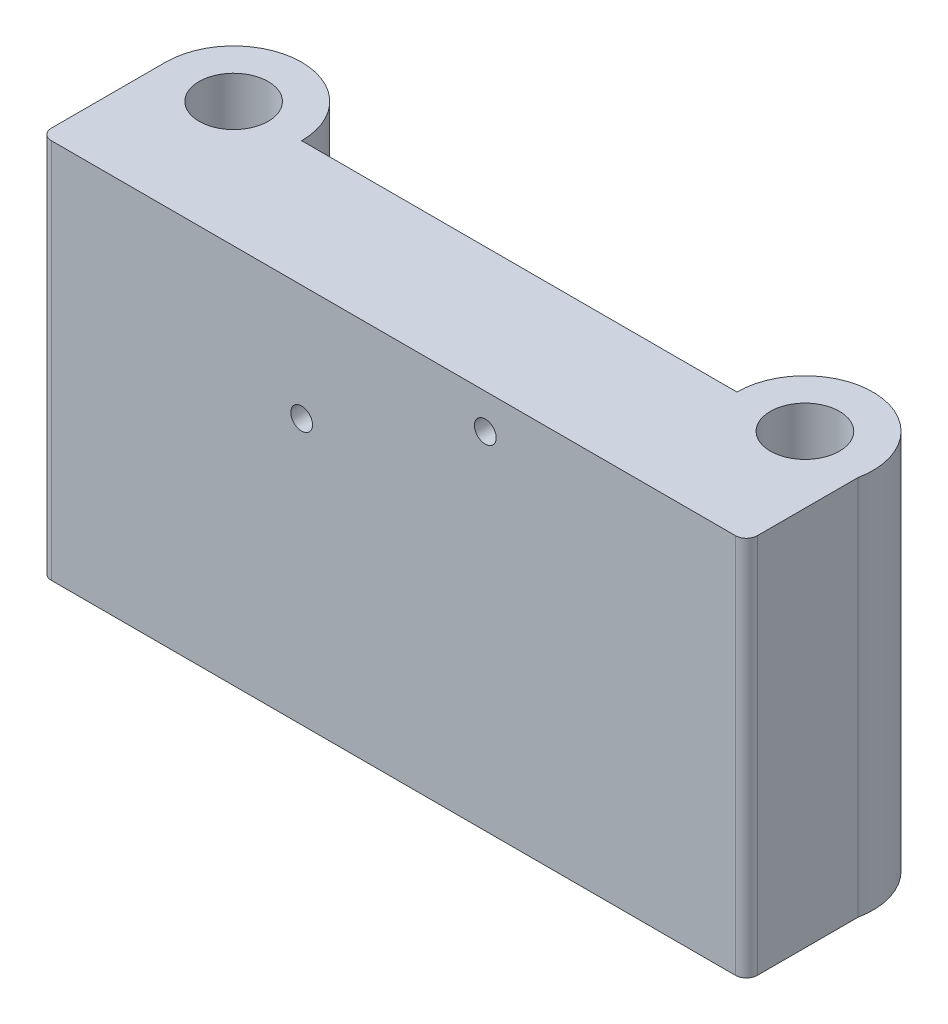
ISO-10303-21;
HEADER;
FILE_DESCRIPTION(('STEP AP214'),'2;1');
FILE_NAME('part.step','',(''),(''),'','','');
FILE_SCHEMA(('AUTOMOTIVE_DESIGN { 1 0 10303 214 1 1 1 1 }'));
ENDSEC;
DATA;
#1=APPLICATION_CONTEXT('core data for automotive mechanical design processes');
#2=APPLICATION_PROTOCOL_DEFINITION('international standard','automotive_design',2000,#1);
#3=PRODUCT_CONTEXT('',#1,'mechanical');
#4=PRODUCT('Part','Part','',(#3));
#5=PRODUCT_RELATED_PRODUCT_CATEGORY('part','',(#4));
#6=PRODUCT_DEFINITION_FORMATION('','',#4);
#7=PRODUCT_DEFINITION_CONTEXT('part definition',#1,'design');
#8=PRODUCT_DEFINITION('design','',#6,#7);
#9=PRODUCT_DEFINITION_SHAPE('','',#8);
#10=(LENGTH_UNIT() NAMED_UNIT(*) SI_UNIT(.MILLI.,.METRE.));
#11=(NAMED_UNIT(*) PLANE_ANGLE_UNIT() SI_UNIT($,.RADIAN.));
#12=(NAMED_UNIT(*) SI_UNIT($,.STERADIAN.) SOLID_ANGLE_UNIT());
#13=UNCERTAINTY_MEASURE_WITH_UNIT(LENGTH_MEASURE(1.E-05),#10,'distance_accuracy_value','');
#14=(GEOMETRIC_REPRESENTATION_CONTEXT(3) GLOBAL_UNCERTAINTY_ASSIGNED_CONTEXT((#13)) GLOBAL_UNIT_ASSIGNED_CONTEXT((#10,
#11,#12)) REPRESENTATION_CONTEXT('',''));
#15=CARTESIAN_POINT('',(0.,0.,0.));
#16=DIRECTION('',(0.,0.,1.));
#17=DIRECTION('',(1.,0.,0.));
#18=AXIS2_PLACEMENT_3D('',#15,#16,#17);
#19=CARTESIAN_POINT('',(21.2704680550241,0.,0.));
#20=DIRECTION('',(0.,1.,0.));
#21=DIRECTION('',(0.,0.,1.));
#22=AXIS2_PLACEMENT_3D('',#19,#20,#21);
#23=CYLINDRICAL_SURFACE('',#22,3.175);
#24=CARTESIAN_POINT('',(21.2704680550241,35.,0.));
#25=DIRECTION('',(0.,1.,0.));
#26=DIRECTION('',(0.,0.,1.));
#27=AXIS2_PLACEMENT_3D('',#24,#25,#26);
#28=CIRCLE('',#27,3.175);
#29=CARTESIAN_POINT('',(21.2704680550241,35.,3.175));
#30=VERTEX_POINT('',#29);
#31=EDGE_CURVE('E151',#30,#30,#28,.T.);
#32=ORIENTED_EDGE('',*,*,#31,.T.);
#33=EDGE_LOOP('',(#32));
#34=FACE_BOUND('',#33,.T.);
#35=CARTESIAN_POINT('',(21.2704680550241,9.,0.));
#36=DIRECTION('',(0.,-1.,0.));
#37=DIRECTION('',(0.,0.,-1.));
#38=AXIS2_PLACEMENT_3D('',#35,#36,#37);
#39=CIRCLE('',#38,3.175);
#40=CARTESIAN_POINT('',(21.2704680550241,9.,-3.175));
#41=VERTEX_POINT('',#40);
#42=EDGE_CURVE('E146',#41,#41,#39,.F.);
#43=ORIENTED_EDGE('',*,*,#42,.F.);
#44=EDGE_LOOP('',(#43));
#45=FACE_BOUND('',#44,.T.);
#46=ADVANCED_FACE('F38',(#34,#45),#23,.F.);
#47=CARTESIAN_POINT('',(-31.235807588018,0.,0.));
#48=DIRECTION('',(0.,1.,0.));
#49=DIRECTION('',(0.,0.,1.));
#50=AXIS2_PLACEMENT_3D('',#47,#48,#49);
#51=CYLINDRICAL_SURFACE('',#50,3.175);
#52=CARTESIAN_POINT('',(-31.235807588018,35.,0.));
#53=DIRECTION('',(0.,1.,0.));
#54=DIRECTION('',(0.,0.,1.));
#55=AXIS2_PLACEMENT_3D('',#52,#53,#54);
#56=CIRCLE('',#55,3.175);
#57=CARTESIAN_POINT('',(-31.235807588018,35.,3.175));
#58=VERTEX_POINT('',#57);
#59=EDGE_CURVE('E222',#58,#58,#56,.T.);
#60=ORIENTED_EDGE('',*,*,#59,.T.);
#61=EDGE_LOOP('',(#60));
#62=FACE_BOUND('',#61,.T.);
#63=CARTESIAN_POINT('',(-31.235807588018,9.,0.));
#64=DIRECTION('',(0.,-1.,0.));
#65=DIRECTION('',(0.,0.,-1.));
#66=AXIS2_PLACEMENT_3D('',#63,#64,#65);
#67=CIRCLE('',#66,3.175);
#68=CARTESIAN_POINT('',(-31.235807588018,9.,-3.175));
#69=VERTEX_POINT('',#68);
#70=EDGE_CURVE('E142',#69,#69,#67,.F.);
#71=ORIENTED_EDGE('',*,*,#70,.F.);
#72=EDGE_LOOP('',(#71));
#73=FACE_BOUND('',#72,.T.);
#74=ADVANCED_FACE('F287',(#62,#73),#51,.F.);
#75=CARTESIAN_POINT('',(-31.235807588018,35.,0.));
#76=DIRECTION('',(0.,-1.,0.));
#77=DIRECTION('',(0.,0.,-1.));
#78=AXIS2_PLACEMENT_3D('',#75,#76,#77);
#79=CYLINDRICAL_SURFACE('',#78,6.25);
#80=CARTESIAN_POINT('',(-31.235807588018,0.,0.));
#81=DIRECTION('',(0.,1.,0.));
#82=DIRECTION('',(0.,0.,1.));
#83=AXIS2_PLACEMENT_3D('',#80,#81,#82);
#84=CIRCLE('',#83,6.25);
#85=CARTESIAN_POINT('',(-24.985807588018,0.,0.));
#86=VERTEX_POINT('',#85);
#87=CARTESIAN_POINT('',(-37.485807588018,0.,0.));
#88=VERTEX_POINT('',#87);
#89=EDGE_CURVE('E127',#86,#88,#84,.T.);
#90=ORIENTED_EDGE('',*,*,#89,.T.);
#91=DIRECTION('',(0.,-1.,0.));
#92=VECTOR('',#91,1.);
#93=CARTESIAN_POINT('',(-37.485807588018,35.,0.));
#94=LINE('',#93,#92);
#95=CARTESIAN_POINT('',(-37.485807588018,35.,0.));
#96=VERTEX_POINT('',#95);
#97=EDGE_CURVE('E107',#96,#88,#94,.T.);
#98=ORIENTED_EDGE('',*,*,#97,.F.);
#99=CARTESIAN_POINT('',(-31.235807588018,35.,0.));
#100=DIRECTION('',(0.,1.,0.));
#101=DIRECTION('',(0.,0.,1.));
#102=AXIS2_PLACEMENT_3D('',#99,#100,#101);
#103=CIRCLE('',#102,6.25);
#104=CARTESIAN_POINT('',(-24.985807588018,35.,0.));
#105=VERTEX_POINT('',#104);
#106=EDGE_CURVE('E113',#105,#96,#103,.T.);
#107=ORIENTED_EDGE('',*,*,#106,.F.);
#108=DIRECTION('',(0.,-1.,0.));
#109=VECTOR('',#108,1.);
#110=CARTESIAN_POINT('',(-24.985807588018,35.,0.));
#111=LINE('',#110,#109);
#112=EDGE_CURVE('E212',#105,#86,#111,.T.);
#113=ORIENTED_EDGE('',*,*,#112,.T.);
#114=EDGE_LOOP('',(#90,#98,#107,#113));
#115=FACE_BOUND('',#114,.T.);
#116=ADVANCED_FACE('F125',(#115),#79,.T.);
#117=CARTESIAN_POINT('',(-37.485807588018,35.,0.));
#118=DIRECTION('',(1.,0.,0.));
#119=DIRECTION('',(0.,0.,-1.));
#120=AXIS2_PLACEMENT_3D('',#117,#118,#119);
#121=PLANE('',#120);
#122=DIRECTION('',(0.,0.,1.));
#123=VECTOR('',#122,1.);
#124=CARTESIAN_POINT('',(-37.485807588018,0.,0.));
#125=LINE('',#124,#123);
#126=CARTESIAN_POINT('',(-37.485807588018,0.,10.5));
#127=VERTEX_POINT('',#126);
#128=EDGE_CURVE('E199',#88,#127,#125,.T.);
#129=ORIENTED_EDGE('',*,*,#128,.T.);
#130=DIRECTION('',(0.,-1.,0.));
#131=VECTOR('',#130,1.);
#132=CARTESIAN_POINT('',(-37.485807588018,35.,10.5));
#133=LINE('',#132,#131);
#134=CARTESIAN_POINT('',(-37.485807588018,35.,10.5));
#135=VERTEX_POINT('',#134);
#136=EDGE_CURVE('E11',#127,#135,#133,.F.);
#137=ORIENTED_EDGE('',*,*,#136,.T.);
#138=DIRECTION('',(0.,0.,1.));
#139=VECTOR('',#138,1.);
#140=CARTESIAN_POINT('',(-37.485807588018,35.,0.));
#141=LINE('',#140,#139);
#142=EDGE_CURVE('E103',#96,#135,#141,.T.);
#143=ORIENTED_EDGE('',*,*,#142,.F.);
#144=ORIENTED_EDGE('',*,*,#97,.T.);
#145=EDGE_LOOP('',(#129,#137,#143,#144));
#146=FACE_BOUND('',#145,.T.);
#147=ADVANCED_FACE('F105',(#146),#121,.F.);
#148=CARTESIAN_POINT('',(-37.485807588018,35.,11.5));
#149=DIRECTION('',(0.,0.,-1.));
#150=DIRECTION('',(-1.,0.,0.));
#151=AXIS2_PLACEMENT_3D('',#148,#149,#150);
#152=PLANE('',#151);
#153=CARTESIAN_POINT('',(-13.485807588018,24.385,11.5));
#154=DIRECTION('',(0.,0.,1.));
#155=DIRECTION('',(1.,0.,0.));
#156=AXIS2_PLACEMENT_3D('',#153,#154,#155);
#157=CIRCLE('',#156,1.);
#158=CARTESIAN_POINT('',(-12.485807588018,24.385,11.5));
#159=VERTEX_POINT('',#158);
#160=EDGE_CURVE('E157',#159,#159,#157,.T.);
#161=ORIENTED_EDGE('',*,*,#160,.F.);
#162=EDGE_LOOP('',(#161));
#163=FACE_BOUND('',#162,.T.);
#164=CARTESIAN_POINT('',(3.39419241198202,31.785,11.5));
#165=DIRECTION('',(0.,0.,1.));
#166=DIRECTION('',(1.,0.,0.));
#167=AXIS2_PLACEMENT_3D('',#164,#165,#166);
#168=CIRCLE('',#167,1.);
#169=CARTESIAN_POINT('',(4.39419241198202,31.785,11.5));
#170=VERTEX_POINT('',#169);
#171=EDGE_CURVE('E250',#170,#170,#168,.T.);
#172=ORIENTED_EDGE('',*,*,#171,.F.);
#173=EDGE_LOOP('',(#172));
#174=FACE_BOUND('',#173,.T.);
#175=DIRECTION('',(1.,0.,0.));
#176=VECTOR('',#175,1.);
#177=CARTESIAN_POINT('',(-37.485807588018,0.,11.5));
#178=LINE('',#177,#176);
#179=CARTESIAN_POINT('',(-36.485807588018,0.,11.5));
#180=VERTEX_POINT('',#179);
#181=CARTESIAN_POINT('',(26.394192411982,0.,11.5));
#182=VERTEX_POINT('',#181);
#183=EDGE_CURVE('E193',#180,#182,#178,.T.);
#184=ORIENTED_EDGE('',*,*,#183,.T.);
#185=DIRECTION('',(0.,-1.,0.));
#186=VECTOR('',#185,1.);
#187=CARTESIAN_POINT('',(26.394192411982,35.,11.5));
#188=LINE('',#187,#186);
#189=CARTESIAN_POINT('',(26.394192411982,35.,11.5));
#190=VERTEX_POINT('',#189);
#191=EDGE_CURVE('E60',#182,#190,#188,.F.);
#192=ORIENTED_EDGE('',*,*,#191,.T.);
#193=DIRECTION('',(1.,0.,0.));
#194=VECTOR('',#193,1.);
#195=CARTESIAN_POINT('',(-37.485807588018,35.,11.5));
#196=LINE('',#195,#194);
#197=CARTESIAN_POINT('',(-36.485807588018,35.,11.5));
#198=VERTEX_POINT('',#197);
#199=EDGE_CURVE('E112',#198,#190,#196,.T.);
#200=ORIENTED_EDGE('',*,*,#199,.F.);
#201=DIRECTION('',(0.,-1.,0.));
#202=VECTOR('',#201,1.);
#203=CARTESIAN_POINT('',(-36.485807588018,35.,11.5));
#204=LINE('',#203,#202);
#205=EDGE_CURVE('E167',#198,#180,#204,.T.);
#206=ORIENTED_EDGE('',*,*,#205,.T.);
#207=EDGE_LOOP('',(#184,#192,#200,#206));
#208=FACE_BOUND('',#207,.T.);
#209=ADVANCED_FACE('F196',(#163,#174,#208),#152,.F.);
#210=CARTESIAN_POINT('',(27.394192411982,35.,1.25));
#211=DIRECTION('',(-1.,0.,0.));
#212=DIRECTION('',(0.,0.,1.));
#213=AXIS2_PLACEMENT_3D('',#210,#211,#212);
#214=PLANE('',#213);
#215=DIRECTION('',(0.,0.,-1.));
#216=VECTOR('',#215,1.);
#217=CARTESIAN_POINT('',(27.394192411982,35.,1.25));
#218=LINE('',#217,#216);
#219=CARTESIAN_POINT('',(27.394192411982,35.,10.5));
#220=VERTEX_POINT('',#219);
#221=CARTESIAN_POINT('',(27.394192411982,35.,1.25));
#222=VERTEX_POINT('',#221);
#223=EDGE_CURVE('E178',#220,#222,#218,.T.);
#224=ORIENTED_EDGE('',*,*,#223,.F.);
#225=DIRECTION('',(0.,-1.,0.));
#226=VECTOR('',#225,1.);
#227=CARTESIAN_POINT('',(27.394192411982,35.,10.5));
#228=LINE('',#227,#226);
#229=CARTESIAN_POINT('',(27.394192411982,0.,10.5));
#230=VERTEX_POINT('',#229);
#231=EDGE_CURVE('E129',#220,#230,#228,.T.);
#232=ORIENTED_EDGE('',*,*,#231,.T.);
#233=DIRECTION('',(0.,0.,-1.));
#234=VECTOR('',#233,1.);
#235=CARTESIAN_POINT('',(27.394192411982,0.,1.25));
#236=LINE('',#235,#234);
#237=CARTESIAN_POINT('',(27.394192411982,0.,1.25));
#238=VERTEX_POINT('',#237);
#239=EDGE_CURVE('E195',#230,#238,#236,.T.);
#240=ORIENTED_EDGE('',*,*,#239,.T.);
#241=DIRECTION('',(0.,-1.,0.));
#242=VECTOR('',#241,1.);
#243=CARTESIAN_POINT('',(27.394192411982,35.,1.25));
#244=LINE('',#243,#242);
#245=EDGE_CURVE('E130',#222,#238,#244,.T.);
#246=ORIENTED_EDGE('',*,*,#245,.F.);
#247=EDGE_LOOP('',(#224,#232,#240,#246));
#248=FACE_BOUND('',#247,.T.);
#249=ADVANCED_FACE('F183',(#248),#214,.F.);
#250=CARTESIAN_POINT('',(21.2704680550241,35.,0.));
#251=DIRECTION('',(0.,-1.,0.));
#252=DIRECTION('',(0.,0.,-1.));
#253=AXIS2_PLACEMENT_3D('',#250,#251,#252);
#254=CYLINDRICAL_SURFACE('',#253,6.25);
#255=CARTESIAN_POINT('',(21.2704680550241,0.,0.));
#256=DIRECTION('',(0.,1.,0.));
#257=DIRECTION('',(0.,0.,1.));
#258=AXIS2_PLACEMENT_3D('',#255,#256,#257);
#259=CIRCLE('',#258,6.25);
#260=CARTESIAN_POINT('',(15.0204680550241,0.,0.));
#261=VERTEX_POINT('',#260);
#262=EDGE_CURVE('E203',#238,#261,#259,.T.);
#263=ORIENTED_EDGE('',*,*,#262,.T.);
#264=DIRECTION('',(0.,-1.,0.));
#265=VECTOR('',#264,1.);
#266=CARTESIAN_POINT('',(15.0204680550241,35.,0.));
#267=LINE('',#266,#265);
#268=CARTESIAN_POINT('',(15.0204680550241,35.,0.));
#269=VERTEX_POINT('',#268);
#270=EDGE_CURVE('E138',#269,#261,#267,.T.);
#271=ORIENTED_EDGE('',*,*,#270,.F.);
#272=CARTESIAN_POINT('',(21.2704680550241,35.,0.));
#273=DIRECTION('',(0.,1.,0.));
#274=DIRECTION('',(0.,0.,1.));
#275=AXIS2_PLACEMENT_3D('',#272,#273,#274);
#276=CIRCLE('',#275,6.25);
#277=EDGE_CURVE('E187',#222,#269,#276,.T.);
#278=ORIENTED_EDGE('',*,*,#277,.F.);
#279=ORIENTED_EDGE('',*,*,#245,.T.);
#280=EDGE_LOOP('',(#263,#271,#278,#279));
#281=FACE_BOUND('',#280,.T.);
#282=ADVANCED_FACE('F274',(#281),#254,.T.);
#283=CARTESIAN_POINT('',(-24.985807588018,35.,0.));
#284=DIRECTION('',(0.,0.,1.));
#285=DIRECTION('',(1.,0.,0.));
#286=AXIS2_PLACEMENT_3D('',#283,#284,#285);
#287=PLANE('',#286);
#288=CARTESIAN_POINT('',(-13.485807588018,24.385,0.));
#289=DIRECTION('',(0.,0.,1.));
#290=DIRECTION('',(1.,0.,0.));
#291=AXIS2_PLACEMENT_3D('',#288,#289,#290);
#292=CIRCLE('',#291,1.);
#293=CARTESIAN_POINT('',(-12.485807588018,24.385,0.));
#294=VERTEX_POINT('',#293);
#295=EDGE_CURVE('E156',#294,#294,#292,.T.);
#296=ORIENTED_EDGE('',*,*,#295,.T.);
#297=EDGE_LOOP('',(#296));
#298=FACE_BOUND('',#297,.T.);
#299=CARTESIAN_POINT('',(3.39419241198202,31.785,0.));
#300=DIRECTION('',(0.,0.,1.));
#301=DIRECTION('',(1.,0.,0.));
#302=AXIS2_PLACEMENT_3D('',#299,#300,#301);
#303=CIRCLE('',#302,1.);
#304=CARTESIAN_POINT('',(4.39419241198202,31.785,0.));
#305=VERTEX_POINT('',#304);
#306=EDGE_CURVE('E152',#305,#305,#303,.T.);
#307=ORIENTED_EDGE('',*,*,#306,.T.);
#308=EDGE_LOOP('',(#307));
#309=FACE_BOUND('',#308,.T.);
#310=DIRECTION('',(-1.,0.,0.));
#311=VECTOR('',#310,1.);
#312=CARTESIAN_POINT('',(-24.985807588018,0.,0.));
#313=LINE('',#312,#311);
#314=EDGE_CURVE('E123',#261,#86,#313,.T.);
#315=ORIENTED_EDGE('',*,*,#314,.T.);
#316=ORIENTED_EDGE('',*,*,#112,.F.);
#317=DIRECTION('',(-1.,0.,0.));
#318=VECTOR('',#317,1.);
#319=CARTESIAN_POINT('',(-24.985807588018,35.,0.));
#320=LINE('',#319,#318);
#321=EDGE_CURVE('E118',#269,#105,#320,.T.);
#322=ORIENTED_EDGE('',*,*,#321,.F.);
#323=ORIENTED_EDGE('',*,*,#270,.T.);
#324=EDGE_LOOP('',(#315,#316,#322,#323));
#325=FACE_BOUND('',#324,.T.);
#326=ADVANCED_FACE('F219',(#298,#309,#325),#287,.F.);
#327=CARTESIAN_POINT('',(-31.235807588018,35.,0.));
#328=DIRECTION('',(0.,1.,0.));
#329=DIRECTION('',(0.,0.,1.));
#330=AXIS2_PLACEMENT_3D('',#327,#328,#329);
#331=PLANE('',#330);
#332=ORIENTED_EDGE('',*,*,#59,.F.);
#333=EDGE_LOOP('',(#332));
#334=FACE_BOUND('',#333,.T.);
#335=ORIENTED_EDGE('',*,*,#31,.F.);
#336=EDGE_LOOP('',(#335));
#337=FACE_BOUND('',#336,.T.);
#338=ORIENTED_EDGE('',*,*,#199,.T.);
#339=CARTESIAN_POINT('',(26.394192411982,35.,10.5));
#340=DIRECTION('',(0.,1.,0.));
#341=DIRECTION('',(0.,0.,1.));
#342=AXIS2_PLACEMENT_3D('',#339,#340,#341);
#343=CIRCLE('',#342,1.);
#344=EDGE_CURVE('E47',#190,#220,#343,.T.);
#345=ORIENTED_EDGE('',*,*,#344,.T.);
#346=ORIENTED_EDGE('',*,*,#223,.T.);
#347=ORIENTED_EDGE('',*,*,#277,.T.);
#348=ORIENTED_EDGE('',*,*,#321,.T.);
#349=ORIENTED_EDGE('',*,*,#106,.T.);
#350=ORIENTED_EDGE('',*,*,#142,.T.);
#351=CARTESIAN_POINT('',(-36.485807588018,35.,10.5));
#352=DIRECTION('',(0.,1.,0.));
#353=DIRECTION('',(0.,0.,1.));
#354=AXIS2_PLACEMENT_3D('',#351,#352,#353);
#355=CIRCLE('',#354,1.);
#356=EDGE_CURVE('E173',#135,#198,#355,.T.);
#357=ORIENTED_EDGE('',*,*,#356,.T.);
#358=EDGE_LOOP('',(#338,#345,#346,#347,#348,#349,#350,#357));
#359=FACE_BOUND('',#358,.T.);
#360=ADVANCED_FACE('F116',(#334,#337,#359),#331,.T.);
#361=CARTESIAN_POINT('',(-31.235807588018,0.,0.));
#362=DIRECTION('',(0.,1.,0.));
#363=DIRECTION('',(0.,0.,1.));
#364=AXIS2_PLACEMENT_3D('',#361,#362,#363);
#365=PLANE('',#364);
#366=CARTESIAN_POINT('',(21.2704680550241,0.,0.));
#367=DIRECTION('',(0.,-1.,0.));
#368=DIRECTION('',(0.,0.,-1.));
#369=AXIS2_PLACEMENT_3D('',#366,#367,#368);
#370=CIRCLE('',#369,4.25);
#371=CARTESIAN_POINT('',(21.2704680550241,0.,-4.25));
#372=VERTEX_POINT('',#371);
#373=EDGE_CURVE('E243',#372,#372,#370,.T.);
#374=ORIENTED_EDGE('',*,*,#373,.F.);
#375=EDGE_LOOP('',(#374));
#376=FACE_BOUND('',#375,.T.);
#377=CARTESIAN_POINT('',(-31.235807588018,0.,0.));
#378=DIRECTION('',(0.,-1.,0.));
#379=DIRECTION('',(0.,0.,-1.));
#380=AXIS2_PLACEMENT_3D('',#377,#378,#379);
#381=CIRCLE('',#380,4.25);
#382=CARTESIAN_POINT('',(-31.235807588018,0.,-4.25));
#383=VERTEX_POINT('',#382);
#384=EDGE_CURVE('E160',#383,#383,#381,.T.);
#385=ORIENTED_EDGE('',*,*,#384,.F.);
#386=EDGE_LOOP('',(#385));
#387=FACE_BOUND('',#386,.T.);
#388=ORIENTED_EDGE('',*,*,#239,.F.);
#389=CARTESIAN_POINT('',(26.394192411982,0.,10.5));
#390=DIRECTION('',(0.,1.,0.));
#391=DIRECTION('',(0.,0.,1.));
#392=AXIS2_PLACEMENT_3D('',#389,#390,#391);
#393=CIRCLE('',#392,1.);
#394=EDGE_CURVE('E164',#230,#182,#393,.F.);
#395=ORIENTED_EDGE('',*,*,#394,.T.);
#396=ORIENTED_EDGE('',*,*,#183,.F.);
#397=CARTESIAN_POINT('',(-36.485807588018,0.,10.5));
#398=DIRECTION('',(0.,1.,0.));
#399=DIRECTION('',(0.,0.,1.));
#400=AXIS2_PLACEMENT_3D('',#397,#398,#399);
#401=CIRCLE('',#400,1.);
#402=EDGE_CURVE('E135',#180,#127,#401,.F.);
#403=ORIENTED_EDGE('',*,*,#402,.T.);
#404=ORIENTED_EDGE('',*,*,#128,.F.);
#405=ORIENTED_EDGE('',*,*,#89,.F.);
#406=ORIENTED_EDGE('',*,*,#314,.F.);
#407=ORIENTED_EDGE('',*,*,#262,.F.);
#408=EDGE_LOOP('',(#388,#395,#396,#403,#404,#405,#406,#407));
#409=FACE_BOUND('',#408,.T.);
#410=ADVANCED_FACE('F192',(#376,#387,#409),#365,.F.);
#411=CARTESIAN_POINT('',(-31.235807588018,9.,0.));
#412=DIRECTION('',(0.,-1.,0.));
#413=DIRECTION('',(0.,0.,-1.));
#414=AXIS2_PLACEMENT_3D('',#411,#412,#413);
#415=PLANE('',#414);
#416=CARTESIAN_POINT('',(-31.235807588018,9.,0.));
#417=DIRECTION('',(0.,-1.,0.));
#418=DIRECTION('',(0.,0.,-1.));
#419=AXIS2_PLACEMENT_3D('',#416,#417,#418);
#420=CIRCLE('',#419,4.25);
#421=CARTESIAN_POINT('',(-31.235807588018,9.,-4.25));
#422=VERTEX_POINT('',#421);
#423=EDGE_CURVE('E239',#422,#422,#420,.T.);
#424=ORIENTED_EDGE('',*,*,#423,.T.);
#425=EDGE_LOOP('',(#424));
#426=FACE_BOUND('',#425,.T.);
#427=ORIENTED_EDGE('',*,*,#70,.T.);
#428=EDGE_LOOP('',(#427));
#429=FACE_BOUND('',#428,.T.);
#430=ADVANCED_FACE('F298',(#426,#429),#415,.T.);
#431=CARTESIAN_POINT('',(-31.235807588018,9.,0.));
#432=DIRECTION('',(0.,-1.,0.));
#433=DIRECTION('',(0.,0.,-1.));
#434=AXIS2_PLACEMENT_3D('',#431,#432,#433);
#435=CYLINDRICAL_SURFACE('',#434,4.25);
#436=ORIENTED_EDGE('',*,*,#423,.F.);
#437=EDGE_LOOP('',(#436));
#438=FACE_BOUND('',#437,.T.);
#439=ORIENTED_EDGE('',*,*,#384,.T.);
#440=EDGE_LOOP('',(#439));
#441=FACE_BOUND('',#440,.T.);
#442=ADVANCED_FACE('F304',(#438,#441),#435,.F.);
#443=CARTESIAN_POINT('',(21.2704680550241,9.,0.));
#444=DIRECTION('',(0.,-1.,0.));
#445=DIRECTION('',(0.,0.,-1.));
#446=AXIS2_PLACEMENT_3D('',#443,#444,#445);
#447=PLANE('',#446);
#448=CARTESIAN_POINT('',(21.2704680550241,9.,0.));
#449=DIRECTION('',(0.,-1.,0.));
#450=DIRECTION('',(0.,0.,-1.));
#451=AXIS2_PLACEMENT_3D('',#448,#449,#450);
#452=CIRCLE('',#451,4.25);
#453=CARTESIAN_POINT('',(21.2704680550241,9.,-4.25));
#454=VERTEX_POINT('',#453);
#455=EDGE_CURVE('E147',#454,#454,#452,.T.);
#456=ORIENTED_EDGE('',*,*,#455,.T.);
#457=EDGE_LOOP('',(#456));
#458=FACE_BOUND('',#457,.T.);
#459=ORIENTED_EDGE('',*,*,#42,.T.);
#460=EDGE_LOOP('',(#459));
#461=FACE_BOUND('',#460,.T.);
#462=ADVANCED_FACE('F312',(#458,#461),#447,.T.);
#463=CARTESIAN_POINT('',(21.2704680550241,9.,0.));
#464=DIRECTION('',(0.,-1.,0.));
#465=DIRECTION('',(0.,0.,-1.));
#466=AXIS2_PLACEMENT_3D('',#463,#464,#465);
#467=CYLINDRICAL_SURFACE('',#466,4.25);
#468=ORIENTED_EDGE('',*,*,#455,.F.);
#469=EDGE_LOOP('',(#468));
#470=FACE_BOUND('',#469,.T.);
#471=ORIENTED_EDGE('',*,*,#373,.T.);
#472=EDGE_LOOP('',(#471));
#473=FACE_BOUND('',#472,.T.);
#474=ADVANCED_FACE('F269',(#470,#473),#467,.F.);
#475=CARTESIAN_POINT('',(3.39419241198202,31.785,-6.25));
#476=DIRECTION('',(0.,0.,1.));
#477=DIRECTION('',(1.,0.,0.));
#478=AXIS2_PLACEMENT_3D('',#475,#476,#477);
#479=CYLINDRICAL_SURFACE('',#478,1.);
#480=ORIENTED_EDGE('',*,*,#171,.T.);
#481=EDGE_LOOP('',(#480));
#482=FACE_BOUND('',#481,.T.);
#483=ORIENTED_EDGE('',*,*,#306,.F.);
#484=EDGE_LOOP('',(#483));
#485=FACE_BOUND('',#484,.T.);
#486=ADVANCED_FACE('F266',(#482,#485),#479,.F.);
#487=CARTESIAN_POINT('',(-13.485807588018,24.385,-6.25));
#488=DIRECTION('',(0.,0.,1.));
#489=DIRECTION('',(1.,0.,0.));
#490=AXIS2_PLACEMENT_3D('',#487,#488,#489);
#491=CYLINDRICAL_SURFACE('',#490,1.);
#492=ORIENTED_EDGE('',*,*,#160,.T.);
#493=EDGE_LOOP('',(#492));
#494=FACE_BOUND('',#493,.T.);
#495=ORIENTED_EDGE('',*,*,#295,.F.);
#496=EDGE_LOOP('',(#495));
#497=FACE_BOUND('',#496,.T.);
#498=ADVANCED_FACE('F258',(#494,#497),#491,.F.);
#499=CARTESIAN_POINT('',(26.394192411982,35.,10.5));
#500=DIRECTION('',(0.,-1.,0.));
#501=DIRECTION('',(0.,0.,-1.));
#502=AXIS2_PLACEMENT_3D('',#499,#500,#501);
#503=CYLINDRICAL_SURFACE('',#502,1.);
#504=ORIENTED_EDGE('',*,*,#344,.F.);
#505=ORIENTED_EDGE('',*,*,#191,.F.);
#506=ORIENTED_EDGE('',*,*,#394,.F.);
#507=ORIENTED_EDGE('',*,*,#231,.F.);
#508=EDGE_LOOP('',(#504,#505,#506,#507));
#509=FACE_BOUND('',#508,.T.);
#510=ADVANCED_FACE('F189',(#509),#503,.T.);
#511=CARTESIAN_POINT('',(-36.485807588018,35.,10.5));
#512=DIRECTION('',(0.,-1.,0.));
#513=DIRECTION('',(0.,0.,-1.));
#514=AXIS2_PLACEMENT_3D('',#511,#512,#513);
#515=CYLINDRICAL_SURFACE('',#514,1.);
#516=ORIENTED_EDGE('',*,*,#356,.F.);
#517=ORIENTED_EDGE('',*,*,#136,.F.);
#518=ORIENTED_EDGE('',*,*,#402,.F.);
#519=ORIENTED_EDGE('',*,*,#205,.F.);
#520=EDGE_LOOP('',(#516,#517,#518,#519));
#521=FACE_BOUND('',#520,.T.);
#522=ADVANCED_FACE('F40',(#521),#515,.T.);
#523=CLOSED_SHELL('',(#46,#74,#116,#147,#209,#249,#282,#326,#360,#410,#430,#442,#462,#474,#486,
#498,#510,#522));
#524=MANIFOLD_SOLID_BREP('B2',#523);
#525=ADVANCED_BREP_SHAPE_REPRESENTATION('',(#18,#524),#14);
#526=SHAPE_DEFINITION_REPRESENTATION(#9,#525);
ENDSEC;
END-ISO-10303-21;
